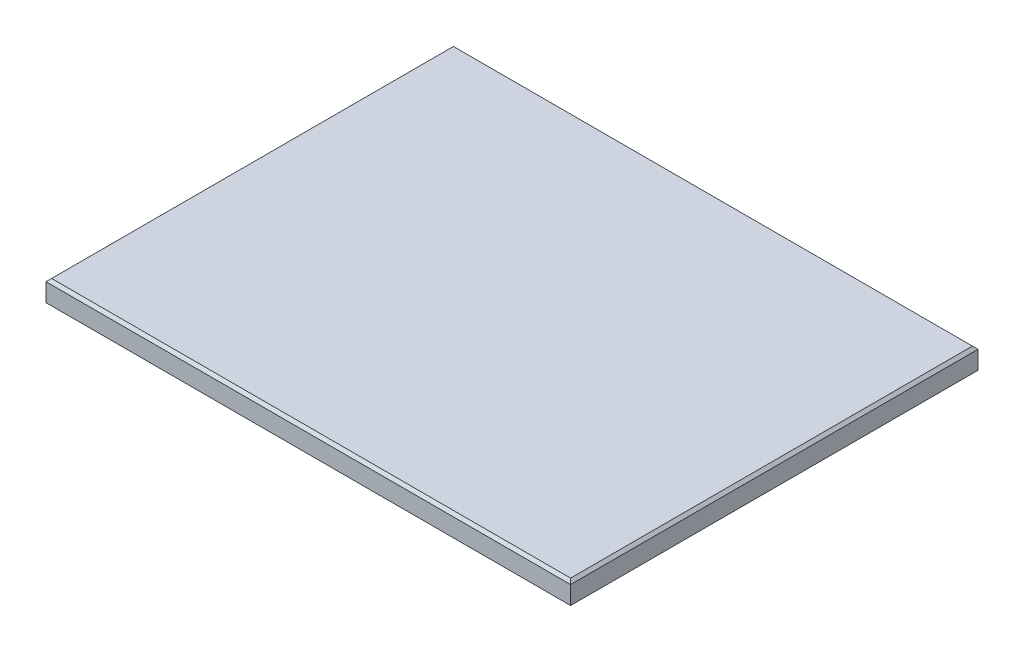
ISO-10303-21;
HEADER;
FILE_DESCRIPTION(('STEP AP214'),'2;1');
FILE_NAME('part.step','',(''),(''),'','','');
FILE_SCHEMA(('AUTOMOTIVE_DESIGN { 1 0 10303 214 1 1 1 1 }'));
ENDSEC;
DATA;
#1=APPLICATION_CONTEXT('core data for automotive mechanical design processes');
#2=APPLICATION_PROTOCOL_DEFINITION('international standard','automotive_design',2000,#1);
#3=PRODUCT_CONTEXT('',#1,'mechanical');
#4=PRODUCT('Part','Part','',(#3));
#5=PRODUCT_RELATED_PRODUCT_CATEGORY('part','',(#4));
#6=PRODUCT_DEFINITION_FORMATION('','',#4);
#7=PRODUCT_DEFINITION_CONTEXT('part definition',#1,'design');
#8=PRODUCT_DEFINITION('design','',#6,#7);
#9=PRODUCT_DEFINITION_SHAPE('','',#8);
#10=(LENGTH_UNIT() NAMED_UNIT(*) SI_UNIT(.MILLI.,.METRE.));
#11=(NAMED_UNIT(*) PLANE_ANGLE_UNIT() SI_UNIT($,.RADIAN.));
#12=(NAMED_UNIT(*) SI_UNIT($,.STERADIAN.) SOLID_ANGLE_UNIT());
#13=UNCERTAINTY_MEASURE_WITH_UNIT(LENGTH_MEASURE(1.E-05),#10,'distance_accuracy_value','');
#14=(GEOMETRIC_REPRESENTATION_CONTEXT(3) GLOBAL_UNCERTAINTY_ASSIGNED_CONTEXT((#13)) GLOBAL_UNIT_ASSIGNED_CONTEXT((#10,
#11,#12)) REPRESENTATION_CONTEXT('',''));
#15=CARTESIAN_POINT('',(0.,0.,0.));
#16=DIRECTION('',(0.,0.,1.));
#17=DIRECTION('',(1.,0.,0.));
#18=AXIS2_PLACEMENT_3D('',#15,#16,#17);
#19=CARTESIAN_POINT('',(0.,19.05,0.));
#20=DIRECTION('',(1.,0.,0.));
#21=DIRECTION('',(0.,0.,-1.));
#22=AXIS2_PLACEMENT_3D('',#19,#20,#21);
#23=PLANE('',#22);
#24=DIRECTION('',(0.,-1.,0.));
#25=VECTOR('',#24,1.);
#26=CARTESIAN_POINT('',(0.,19.05,0.));
#27=LINE('',#26,#25);
#28=CARTESIAN_POINT('',(0.,16.5100000000001,0.));
#29=VERTEX_POINT('',#28);
#30=CARTESIAN_POINT('',(0.,0.,0.));
#31=VERTEX_POINT('',#30);
#32=EDGE_CURVE('E93',#29,#31,#27,.T.);
#33=ORIENTED_EDGE('',*,*,#32,.F.);
#34=DIRECTION('',(0.,0.,-1.));
#35=VECTOR('',#34,1.);
#36=CARTESIAN_POINT('',(0.,16.5100000000001,0.));
#37=LINE('',#36,#35);
#38=CARTESIAN_POINT('',(0.,16.5100000000001,-369.8875));
#39=VERTEX_POINT('',#38);
#40=EDGE_CURVE('E11',#29,#39,#37,.T.);
#41=ORIENTED_EDGE('',*,*,#40,.T.);
#42=DIRECTION('',(0.,-1.,0.));
#43=VECTOR('',#42,1.);
#44=CARTESIAN_POINT('',(0.,19.05,-369.8875));
#45=LINE('',#44,#43);
#46=CARTESIAN_POINT('',(0.,0.,-369.8875));
#47=VERTEX_POINT('',#46);
#48=EDGE_CURVE('E113',#39,#47,#45,.T.);
#49=ORIENTED_EDGE('',*,*,#48,.T.);
#50=DIRECTION('',(0.,0.,1.));
#51=VECTOR('',#50,1.);
#52=CARTESIAN_POINT('',(0.,0.,0.));
#53=LINE('',#52,#51);
#54=EDGE_CURVE('E108',#47,#31,#53,.T.);
#55=ORIENTED_EDGE('',*,*,#54,.T.);
#56=EDGE_LOOP('',(#33,#41,#49,#55));
#57=FACE_BOUND('',#56,.T.);
#58=ADVANCED_FACE('F40',(#57),#23,.F.);
#59=CARTESIAN_POINT('',(0.,19.05,0.));
#60=DIRECTION('',(0.,0.,-1.));
#61=DIRECTION('',(-1.,0.,0.));
#62=AXIS2_PLACEMENT_3D('',#59,#60,#61);
#63=PLANE('',#62);
#64=DIRECTION('',(0.,-1.,0.));
#65=VECTOR('',#64,1.);
#66=CARTESIAN_POINT('',(476.25,19.05,0.));
#67=LINE('',#66,#65);
#68=CARTESIAN_POINT('',(476.25,16.5100000000001,0.));
#69=VERTEX_POINT('',#68);
#70=CARTESIAN_POINT('',(476.25,0.,0.));
#71=VERTEX_POINT('',#70);
#72=EDGE_CURVE('E102',#69,#71,#67,.T.);
#73=ORIENTED_EDGE('',*,*,#72,.F.);
#74=DIRECTION('',(-1.,0.,0.));
#75=VECTOR('',#74,1.);
#76=CARTESIAN_POINT('',(0.,16.5100000000001,0.));
#77=LINE('',#76,#75);
#78=EDGE_CURVE('E50',#69,#29,#77,.T.);
#79=ORIENTED_EDGE('',*,*,#78,.T.);
#80=ORIENTED_EDGE('',*,*,#32,.T.);
#81=DIRECTION('',(1.,0.,0.));
#82=VECTOR('',#81,1.);
#83=CARTESIAN_POINT('',(0.,0.,0.));
#84=LINE('',#83,#82);
#85=EDGE_CURVE('E96',#31,#71,#84,.T.);
#86=ORIENTED_EDGE('',*,*,#85,.T.);
#87=EDGE_LOOP('',(#73,#79,#80,#86));
#88=FACE_BOUND('',#87,.T.);
#89=ADVANCED_FACE('F95',(#88),#63,.F.);
#90=CARTESIAN_POINT('',(476.25,19.05,0.));
#91=DIRECTION('',(-1.,0.,0.));
#92=DIRECTION('',(0.,0.,1.));
#93=AXIS2_PLACEMENT_3D('',#90,#91,#92);
#94=PLANE('',#93);
#95=DIRECTION('',(0.,-1.,0.));
#96=VECTOR('',#95,1.);
#97=CARTESIAN_POINT('',(476.25,19.05,-369.8875));
#98=LINE('',#97,#96);
#99=CARTESIAN_POINT('',(476.25,16.5100000000001,-369.8875));
#100=VERTEX_POINT('',#99);
#101=CARTESIAN_POINT('',(476.25,0.,-369.8875));
#102=VERTEX_POINT('',#101);
#103=EDGE_CURVE('E123',#100,#102,#98,.T.);
#104=ORIENTED_EDGE('',*,*,#103,.F.);
#105=DIRECTION('',(0.,0.,1.));
#106=VECTOR('',#105,1.);
#107=CARTESIAN_POINT('',(476.25,16.5100000000001,0.));
#108=LINE('',#107,#106);
#109=EDGE_CURVE('E65',#100,#69,#108,.T.);
#110=ORIENTED_EDGE('',*,*,#109,.T.);
#111=ORIENTED_EDGE('',*,*,#72,.T.);
#112=DIRECTION('',(0.,0.,-1.));
#113=VECTOR('',#112,1.);
#114=CARTESIAN_POINT('',(476.25,0.,0.));
#115=LINE('',#114,#113);
#116=EDGE_CURVE('E110',#71,#102,#115,.T.);
#117=ORIENTED_EDGE('',*,*,#116,.T.);
#118=EDGE_LOOP('',(#104,#110,#111,#117));
#119=FACE_BOUND('',#118,.T.);
#120=ADVANCED_FACE('F161',(#119),#94,.F.);
#121=CARTESIAN_POINT('',(0.,19.05,-369.8875));
#122=DIRECTION('',(0.,0.,1.));
#123=DIRECTION('',(1.,0.,0.));
#124=AXIS2_PLACEMENT_3D('',#121,#122,#123);
#125=PLANE('',#124);
#126=ORIENTED_EDGE('',*,*,#48,.F.);
#127=DIRECTION('',(1.,0.,0.));
#128=VECTOR('',#127,1.);
#129=CARTESIAN_POINT('',(0.,16.5100000000001,-369.8875));
#130=LINE('',#129,#128);
#131=EDGE_CURVE('E134',#39,#100,#130,.T.);
#132=ORIENTED_EDGE('',*,*,#131,.T.);
#133=ORIENTED_EDGE('',*,*,#103,.T.);
#134=DIRECTION('',(-1.,0.,0.));
#135=VECTOR('',#134,1.);
#136=CARTESIAN_POINT('',(0.,0.,-369.8875));
#137=LINE('',#136,#135);
#138=EDGE_CURVE('E120',#102,#47,#137,.T.);
#139=ORIENTED_EDGE('',*,*,#138,.T.);
#140=EDGE_LOOP('',(#126,#132,#133,#139));
#141=FACE_BOUND('',#140,.T.);
#142=ADVANCED_FACE('F160',(#141),#125,.F.);
#143=CARTESIAN_POINT('',(0.,19.05,0.));
#144=DIRECTION('',(0.,-1.,0.));
#145=DIRECTION('',(0.,0.,-1.));
#146=AXIS2_PLACEMENT_3D('',#143,#144,#145);
#147=PLANE('',#146);
#148=DIRECTION('',(0.,0.,-1.));
#149=VECTOR('',#148,1.);
#150=CARTESIAN_POINT('',(473.71,19.05,0.));
#151=LINE('',#150,#149);
#152=CARTESIAN_POINT('',(473.71,19.05,-2.53999999999993));
#153=VERTEX_POINT('',#152);
#154=CARTESIAN_POINT('',(473.71,19.05,-367.3475));
#155=VERTEX_POINT('',#154);
#156=EDGE_CURVE('E129',#153,#155,#151,.T.);
#157=ORIENTED_EDGE('',*,*,#156,.T.);
#158=DIRECTION('',(-1.,0.,0.));
#159=VECTOR('',#158,1.);
#160=CARTESIAN_POINT('',(0.,19.05,-367.3475));
#161=LINE('',#160,#159);
#162=CARTESIAN_POINT('',(2.53999999999993,19.05,-367.3475));
#163=VERTEX_POINT('',#162);
#164=EDGE_CURVE('E131',#155,#163,#161,.T.);
#165=ORIENTED_EDGE('',*,*,#164,.T.);
#166=DIRECTION('',(0.,0.,1.));
#167=VECTOR('',#166,1.);
#168=CARTESIAN_POINT('',(2.53999999999993,19.05,0.));
#169=LINE('',#168,#167);
#170=CARTESIAN_POINT('',(2.53999999999993,19.05,-2.53999999999993));
#171=VERTEX_POINT('',#170);
#172=EDGE_CURVE('E101',#163,#171,#169,.T.);
#173=ORIENTED_EDGE('',*,*,#172,.T.);
#174=DIRECTION('',(1.,0.,0.));
#175=VECTOR('',#174,1.);
#176=CARTESIAN_POINT('',(0.,19.05,-2.53999999999993));
#177=LINE('',#176,#175);
#178=EDGE_CURVE('E127',#171,#153,#177,.T.);
#179=ORIENTED_EDGE('',*,*,#178,.T.);
#180=EDGE_LOOP('',(#157,#165,#173,#179));
#181=FACE_BOUND('',#180,.T.);
#182=ADVANCED_FACE('F153',(#181),#147,.F.);
#183=CARTESIAN_POINT('',(0.,0.,0.));
#184=DIRECTION('',(0.,-1.,0.));
#185=DIRECTION('',(0.,0.,-1.));
#186=AXIS2_PLACEMENT_3D('',#183,#184,#185);
#187=PLANE('',#186);
#188=ORIENTED_EDGE('',*,*,#54,.F.);
#189=ORIENTED_EDGE('',*,*,#138,.F.);
#190=ORIENTED_EDGE('',*,*,#116,.F.);
#191=ORIENTED_EDGE('',*,*,#85,.F.);
#192=EDGE_LOOP('',(#188,#189,#190,#191));
#193=FACE_BOUND('',#192,.T.);
#194=ADVANCED_FACE('F106',(#193),#187,.T.);
#195=CARTESIAN_POINT('',(0.,19.05,-2.53999999999993));
#196=DIRECTION('',(0.,-0.707106781186547,-0.707106781186548));
#197=DIRECTION('',(1.,0.,0.));
#198=AXIS2_PLACEMENT_3D('',#195,#196,#197);
#199=PLANE('',#198);
#200=DIRECTION('',(0.577350269189626,0.577350269189626,-0.577350269189626));
#201=VECTOR('',#200,1.);
#202=CARTESIAN_POINT('',(1.69333333333329,18.2033333333334,-1.69333333333329));
#203=LINE('',#202,#201);
#204=EDGE_CURVE('E117',#29,#171,#203,.T.);
#205=ORIENTED_EDGE('',*,*,#204,.F.);
#206=ORIENTED_EDGE('',*,*,#78,.F.);
#207=DIRECTION('',(-0.577350269189626,0.577350269189626,-0.577350269189626));
#208=VECTOR('',#207,1.);
#209=CARTESIAN_POINT('',(315.806666666667,176.953333333333,-160.443333333333));
#210=LINE('',#209,#208);
#211=EDGE_CURVE('E45',#153,#69,#210,.F.);
#212=ORIENTED_EDGE('',*,*,#211,.F.);
#213=ORIENTED_EDGE('',*,*,#178,.F.);
#214=EDGE_LOOP('',(#205,#206,#212,#213));
#215=FACE_BOUND('',#214,.T.);
#216=ADVANCED_FACE('F43',(#215),#199,.F.);
#217=CARTESIAN_POINT('',(473.71,19.05,0.));
#218=DIRECTION('',(-0.707106781186548,-0.707106781186548,0.));
#219=DIRECTION('',(0.,0.,-1.));
#220=AXIS2_PLACEMENT_3D('',#217,#218,#219);
#221=PLANE('',#220);
#222=ORIENTED_EDGE('',*,*,#211,.T.);
#223=ORIENTED_EDGE('',*,*,#109,.F.);
#224=DIRECTION('',(-0.577350269189626,0.577350269189626,0.577350269189626));
#225=VECTOR('',#224,1.);
#226=CARTESIAN_POINT('',(351.260833333333,141.499166666667,-244.898333333333));
#227=LINE('',#226,#225);
#228=EDGE_CURVE('E141',#155,#100,#227,.F.);
#229=ORIENTED_EDGE('',*,*,#228,.F.);
#230=ORIENTED_EDGE('',*,*,#156,.F.);
#231=EDGE_LOOP('',(#222,#223,#229,#230));
#232=FACE_BOUND('',#231,.T.);
#233=ADVANCED_FACE('F186',(#232),#221,.F.);
#234=CARTESIAN_POINT('',(2.53999999999993,19.05,0.));
#235=DIRECTION('',(0.707106781186548,-0.707106781186547,0.));
#236=DIRECTION('',(0.,0.,1.));
#237=AXIS2_PLACEMENT_3D('',#234,#235,#236);
#238=PLANE('',#237);
#239=ORIENTED_EDGE('',*,*,#204,.T.);
#240=ORIENTED_EDGE('',*,*,#172,.F.);
#241=DIRECTION('',(-0.577350269189626,-0.577350269189626,-0.577350269189626));
#242=VECTOR('',#241,1.);
#243=CARTESIAN_POINT('',(124.989166666667,141.499166666667,-244.898333333333));
#244=LINE('',#243,#242);
#245=EDGE_CURVE('E139',#39,#163,#244,.F.);
#246=ORIENTED_EDGE('',*,*,#245,.F.);
#247=ORIENTED_EDGE('',*,*,#40,.F.);
#248=EDGE_LOOP('',(#239,#240,#246,#247));
#249=FACE_BOUND('',#248,.T.);
#250=ADVANCED_FACE('F146',(#249),#238,.F.);
#251=CARTESIAN_POINT('',(0.,19.05,-367.3475));
#252=DIRECTION('',(0.,-0.707106781186548,0.707106781186548));
#253=DIRECTION('',(-1.,0.,0.));
#254=AXIS2_PLACEMENT_3D('',#251,#252,#253);
#255=PLANE('',#254);
#256=ORIENTED_EDGE('',*,*,#228,.T.);
#257=ORIENTED_EDGE('',*,*,#131,.F.);
#258=ORIENTED_EDGE('',*,*,#245,.T.);
#259=ORIENTED_EDGE('',*,*,#164,.F.);
#260=EDGE_LOOP('',(#256,#257,#258,#259));
#261=FACE_BOUND('',#260,.T.);
#262=ADVANCED_FACE('F157',(#261),#255,.F.);
#263=CLOSED_SHELL('',(#58,#89,#120,#142,#182,#194,#216,#233,#250,#262));
#264=MANIFOLD_SOLID_BREP('B2',#263);
#265=ADVANCED_BREP_SHAPE_REPRESENTATION('',(#18,#264),#14);
#266=SHAPE_DEFINITION_REPRESENTATION(#9,#265);
ENDSEC;
END-ISO-10303-21;
